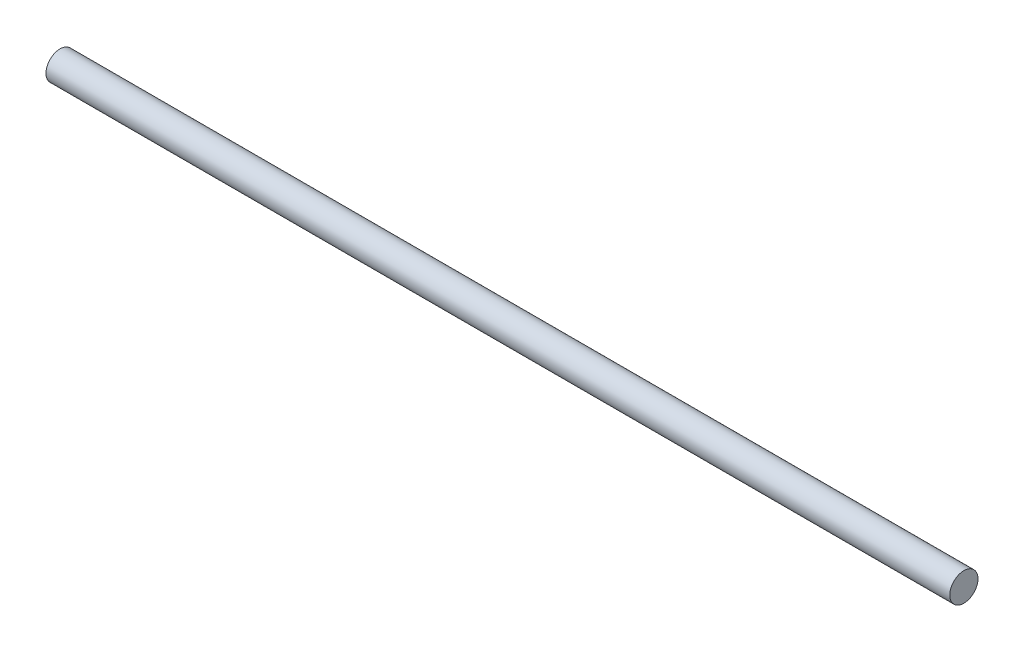
ISO-10303-21;
HEADER;
FILE_DESCRIPTION(('STEP AP214'),'2;1');
FILE_NAME('part.step','',(''),(''),'','','');
FILE_SCHEMA(('AUTOMOTIVE_DESIGN { 1 0 10303 214 1 1 1 1 }'));
ENDSEC;
DATA;
#1=APPLICATION_CONTEXT('core data for automotive mechanical design processes');
#2=APPLICATION_PROTOCOL_DEFINITION('international standard','automotive_design',2000,#1);
#3=PRODUCT_CONTEXT('',#1,'mechanical');
#4=PRODUCT('Part','Part','',(#3));
#5=PRODUCT_RELATED_PRODUCT_CATEGORY('part','',(#4));
#6=PRODUCT_DEFINITION_FORMATION('','',#4);
#7=PRODUCT_DEFINITION_CONTEXT('part definition',#1,'design');
#8=PRODUCT_DEFINITION('design','',#6,#7);
#9=PRODUCT_DEFINITION_SHAPE('','',#8);
#10=(LENGTH_UNIT() NAMED_UNIT(*) SI_UNIT(.MILLI.,.METRE.));
#11=(NAMED_UNIT(*) PLANE_ANGLE_UNIT() SI_UNIT($,.RADIAN.));
#12=(NAMED_UNIT(*) SI_UNIT($,.STERADIAN.) SOLID_ANGLE_UNIT());
#13=UNCERTAINTY_MEASURE_WITH_UNIT(LENGTH_MEASURE(1.E-05),#10,'distance_accuracy_value','');
#14=(GEOMETRIC_REPRESENTATION_CONTEXT(3) GLOBAL_UNCERTAINTY_ASSIGNED_CONTEXT((#13)) GLOBAL_UNIT_ASSIGNED_CONTEXT((#10,
#11,#12)) REPRESENTATION_CONTEXT('',''));
#15=CARTESIAN_POINT('',(0.,0.,0.));
#16=DIRECTION('',(0.,0.,1.));
#17=DIRECTION('',(1.,0.,0.));
#18=AXIS2_PLACEMENT_3D('',#15,#16,#17);
#19=CARTESIAN_POINT('',(101.6,0.,0.));
#20=DIRECTION('',(1.,0.,0.));
#21=DIRECTION('',(0.,0.,-1.));
#22=AXIS2_PLACEMENT_3D('',#19,#20,#21);
#23=PLANE('',#22);
#24=CARTESIAN_POINT('',(101.6,0.,0.));
#25=DIRECTION('',(1.,0.,0.));
#26=DIRECTION('',(0.,0.,-1.));
#27=AXIS2_PLACEMENT_3D('',#24,#25,#26);
#28=CIRCLE('',#27,3.175);
#29=CARTESIAN_POINT('',(101.6,0.,-3.175));
#30=VERTEX_POINT('',#29);
#31=EDGE_CURVE('E18',#30,#30,#28,.F.);
#32=ORIENTED_EDGE('',*,*,#31,.F.);
#33=EDGE_LOOP('',(#32));
#34=FACE_BOUND('',#33,.T.);
#35=ADVANCED_FACE('F15',(#34),#23,.T.);
#36=CARTESIAN_POINT('',(-101.6,0.,0.));
#37=DIRECTION('',(1.,0.,0.));
#38=DIRECTION('',(0.,0.,-1.));
#39=AXIS2_PLACEMENT_3D('',#36,#37,#38);
#40=PLANE('',#39);
#41=CARTESIAN_POINT('',(-101.6,0.,0.));
#42=DIRECTION('',(1.,0.,0.));
#43=DIRECTION('',(0.,0.,-1.));
#44=AXIS2_PLACEMENT_3D('',#41,#42,#43);
#45=CIRCLE('',#44,3.175);
#46=CARTESIAN_POINT('',(-101.6,0.,-3.175));
#47=VERTEX_POINT('',#46);
#48=EDGE_CURVE('E10',#47,#47,#45,.T.);
#49=ORIENTED_EDGE('',*,*,#48,.F.);
#50=EDGE_LOOP('',(#49));
#51=FACE_BOUND('',#50,.T.);
#52=ADVANCED_FACE('F30',(#51),#40,.F.);
#53=CARTESIAN_POINT('',(-101.6,0.,0.));
#54=DIRECTION('',(1.,0.,0.));
#55=DIRECTION('',(0.,0.,-1.));
#56=AXIS2_PLACEMENT_3D('',#53,#54,#55);
#57=CYLINDRICAL_SURFACE('',#56,3.175);
#58=ORIENTED_EDGE('',*,*,#31,.T.);
#59=EDGE_LOOP('',(#58));
#60=FACE_BOUND('',#59,.T.);
#61=ORIENTED_EDGE('',*,*,#48,.T.);
#62=EDGE_LOOP('',(#61));
#63=FACE_BOUND('',#62,.T.);
#64=ADVANCED_FACE('F27',(#60,#63),#57,.T.);
#65=CLOSED_SHELL('',(#35,#52,#64));
#66=MANIFOLD_SOLID_BREP('B1',#65);
#67=ADVANCED_BREP_SHAPE_REPRESENTATION('',(#18,#66),#14);
#68=SHAPE_DEFINITION_REPRESENTATION(#9,#67);
ENDSEC;
END-ISO-10303-21;
